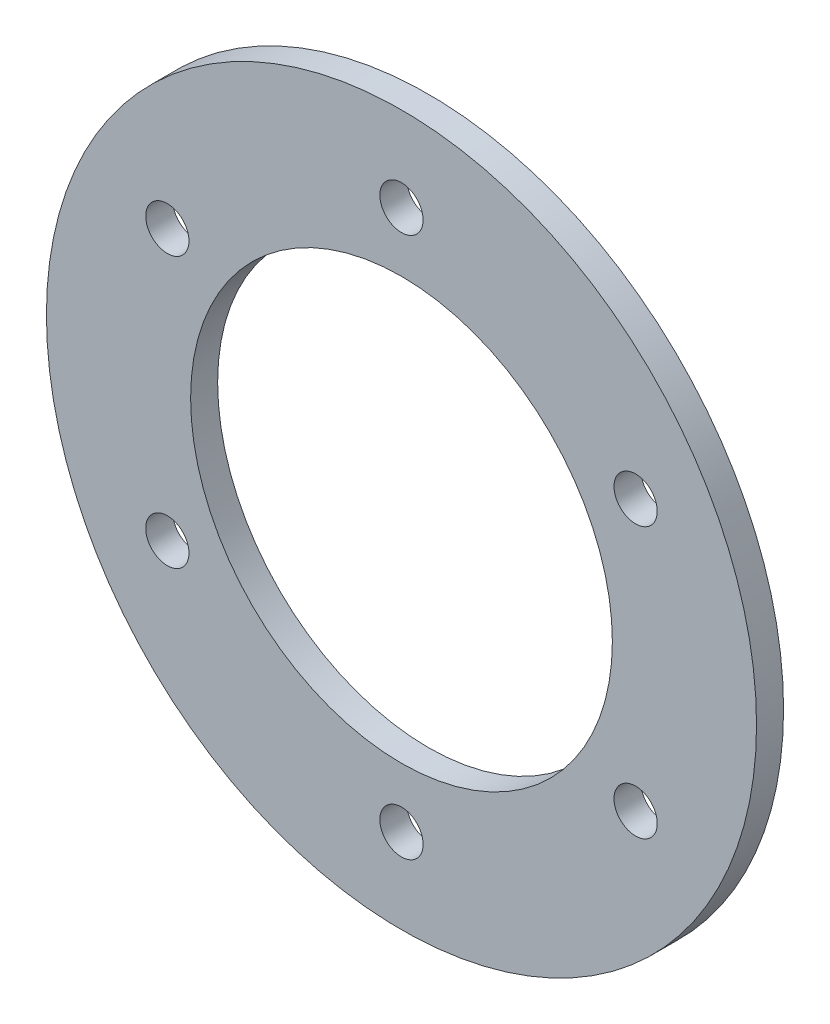
ISO-10303-21;
HEADER;
FILE_DESCRIPTION(('STEP AP214'),'2;1');
FILE_NAME('part.step','',(''),(''),'','','');
FILE_SCHEMA(('AUTOMOTIVE_DESIGN { 1 0 10303 214 1 1 1 1 }'));
ENDSEC;
DATA;
#1=APPLICATION_CONTEXT('core data for automotive mechanical design processes');
#2=APPLICATION_PROTOCOL_DEFINITION('international standard','automotive_design',2000,#1);
#3=PRODUCT_CONTEXT('',#1,'mechanical');
#4=PRODUCT('Part','Part','',(#3));
#5=PRODUCT_RELATED_PRODUCT_CATEGORY('part','',(#4));
#6=PRODUCT_DEFINITION_FORMATION('','',#4);
#7=PRODUCT_DEFINITION_CONTEXT('part definition',#1,'design');
#8=PRODUCT_DEFINITION('design','',#6,#7);
#9=PRODUCT_DEFINITION_SHAPE('','',#8);
#10=(LENGTH_UNIT() NAMED_UNIT(*) SI_UNIT(.MILLI.,.METRE.));
#11=(NAMED_UNIT(*) PLANE_ANGLE_UNIT() SI_UNIT($,.RADIAN.));
#12=(NAMED_UNIT(*) SI_UNIT($,.STERADIAN.) SOLID_ANGLE_UNIT());
#13=UNCERTAINTY_MEASURE_WITH_UNIT(LENGTH_MEASURE(1.E-05),#10,'distance_accuracy_value','');
#14=(GEOMETRIC_REPRESENTATION_CONTEXT(3) GLOBAL_UNCERTAINTY_ASSIGNED_CONTEXT((#13)) GLOBAL_UNIT_ASSIGNED_CONTEXT((#10,
#11,#12)) REPRESENTATION_CONTEXT('',''));
#15=CARTESIAN_POINT('',(0.,0.,0.));
#16=DIRECTION('',(0.,0.,1.));
#17=DIRECTION('',(1.,0.,0.));
#18=AXIS2_PLACEMENT_3D('',#15,#16,#17);
#19=CARTESIAN_POINT('',(0.,0.,0.75));
#20=DIRECTION('',(0.,0.,1.));
#21=DIRECTION('',(1.,0.,0.));
#22=AXIS2_PLACEMENT_3D('',#19,#20,#21);
#23=PLANE('',#22);
#24=CARTESIAN_POINT('',(0.,15.,0.750000000000001));
#25=DIRECTION('',(0.,0.,1.));
#26=DIRECTION('',(1.,0.,0.));
#27=AXIS2_PLACEMENT_3D('',#24,#25,#26);
#28=CIRCLE('',#27,1.19999999999999);
#29=CARTESIAN_POINT('',(1.19999999999999,15.,0.750000000000001));
#30=VERTEX_POINT('',#29);
#31=EDGE_CURVE('E83',#30,#30,#28,.T.);
#32=ORIENTED_EDGE('',*,*,#31,.F.);
#33=EDGE_LOOP('',(#32));
#34=FACE_BOUND('',#33,.T.);
#35=CARTESIAN_POINT('',(12.9903810567669,7.50000000000055,0.750000000000001));
#36=DIRECTION('',(0.,0.,1.));
#37=DIRECTION('',(1.,0.,0.));
#38=AXIS2_PLACEMENT_3D('',#35,#36,#37);
#39=CIRCLE('',#38,1.19999999999999);
#40=CARTESIAN_POINT('',(14.1903810567669,7.50000000000055,0.750000000000001));
#41=VERTEX_POINT('',#40);
#42=EDGE_CURVE('E77',#41,#41,#39,.T.);
#43=ORIENTED_EDGE('',*,*,#42,.F.);
#44=EDGE_LOOP('',(#43));
#45=FACE_BOUND('',#44,.T.);
#46=CARTESIAN_POINT('',(12.9903810567675,-7.49999999999945,0.750000000000001));
#47=DIRECTION('',(0.,0.,1.));
#48=DIRECTION('',(1.,0.,0.));
#49=AXIS2_PLACEMENT_3D('',#46,#47,#48);
#50=CIRCLE('',#49,1.19999999999999);
#51=CARTESIAN_POINT('',(14.1903810567675,-7.49999999999945,0.750000000000001));
#52=VERTEX_POINT('',#51);
#53=EDGE_CURVE('E71',#52,#52,#50,.T.);
#54=ORIENTED_EDGE('',*,*,#53,.F.);
#55=EDGE_LOOP('',(#54));
#56=FACE_BOUND('',#55,.T.);
#57=CARTESIAN_POINT('',(1.27346601377202E-12,-15.,0.750000000000001));
#58=DIRECTION('',(0.,0.,1.));
#59=DIRECTION('',(1.,0.,0.));
#60=AXIS2_PLACEMENT_3D('',#57,#58,#59);
#61=CIRCLE('',#60,1.19999999999999);
#62=CARTESIAN_POINT('',(1.20000000000126,-15.,0.750000000000001));
#63=VERTEX_POINT('',#62);
#64=EDGE_CURVE('E65',#63,#63,#61,.T.);
#65=ORIENTED_EDGE('',*,*,#64,.F.);
#66=EDGE_LOOP('',(#65));
#67=FACE_BOUND('',#66,.T.);
#68=CARTESIAN_POINT('',(-12.9903810567656,-7.50000000000056,0.750000000000001));
#69=DIRECTION('',(0.,0.,1.));
#70=DIRECTION('',(1.,0.,0.));
#71=AXIS2_PLACEMENT_3D('',#68,#69,#70);
#72=CIRCLE('',#71,1.19999999999999);
#73=CARTESIAN_POINT('',(-11.7903810567656,-7.50000000000056,0.750000000000001));
#74=VERTEX_POINT('',#73);
#75=EDGE_CURVE('E59',#74,#74,#72,.T.);
#76=ORIENTED_EDGE('',*,*,#75,.F.);
#77=EDGE_LOOP('',(#76));
#78=FACE_BOUND('',#77,.T.);
#79=CARTESIAN_POINT('',(-12.9903810567663,7.49999999999945,0.750000000000001));
#80=DIRECTION('',(0.,0.,1.));
#81=DIRECTION('',(1.,0.,0.));
#82=AXIS2_PLACEMENT_3D('',#79,#80,#81);
#83=CIRCLE('',#82,1.19999999999999);
#84=CARTESIAN_POINT('',(-11.7903810567663,7.49999999999945,0.750000000000001));
#85=VERTEX_POINT('',#84);
#86=EDGE_CURVE('E53',#85,#85,#83,.T.);
#87=ORIENTED_EDGE('',*,*,#86,.F.);
#88=EDGE_LOOP('',(#87));
#89=FACE_BOUND('',#88,.T.);
#90=CARTESIAN_POINT('',(0.,0.,0.75));
#91=DIRECTION('',(0.,0.,1.));
#92=DIRECTION('',(1.,0.,0.));
#93=AXIS2_PLACEMENT_3D('',#90,#91,#92);
#94=CIRCLE('',#93,19.7);
#95=CARTESIAN_POINT('',(19.7,0.,0.75));
#96=VERTEX_POINT('',#95);
#97=EDGE_CURVE('E10',#96,#96,#94,.T.);
#98=ORIENTED_EDGE('',*,*,#97,.T.);
#99=EDGE_LOOP('',(#98));
#100=FACE_BOUND('',#99,.T.);
#101=CARTESIAN_POINT('',(0.,0.,0.75));
#102=DIRECTION('',(0.,0.,1.));
#103=DIRECTION('',(1.,0.,0.));
#104=AXIS2_PLACEMENT_3D('',#101,#102,#103);
#105=CIRCLE('',#104,11.7);
#106=CARTESIAN_POINT('',(11.7,0.,0.75));
#107=VERTEX_POINT('',#106);
#108=EDGE_CURVE('E43',#107,#107,#105,.T.);
#109=ORIENTED_EDGE('',*,*,#108,.F.);
#110=EDGE_LOOP('',(#109));
#111=FACE_BOUND('',#110,.T.);
#112=ADVANCED_FACE('F32',(#34,#45,#56,#67,#78,#89,#100,#111),#23,.T.);
#113=CARTESIAN_POINT('',(0.,0.,-0.75));
#114=DIRECTION('',(0.,0.,1.));
#115=DIRECTION('',(1.,0.,0.));
#116=AXIS2_PLACEMENT_3D('',#113,#114,#115);
#117=PLANE('',#116);
#118=CARTESIAN_POINT('',(0.,15.,-0.75));
#119=DIRECTION('',(0.,0.,1.));
#120=DIRECTION('',(1.,0.,0.));
#121=AXIS2_PLACEMENT_3D('',#118,#119,#120);
#122=CIRCLE('',#121,1.19999999999999);
#123=CARTESIAN_POINT('',(1.19999999999999,15.,-0.75));
#124=VERTEX_POINT('',#123);
#125=EDGE_CURVE('E80',#124,#124,#122,.T.);
#126=ORIENTED_EDGE('',*,*,#125,.T.);
#127=EDGE_LOOP('',(#126));
#128=FACE_BOUND('',#127,.T.);
#129=CARTESIAN_POINT('',(12.9903810567669,7.50000000000055,-0.75));
#130=DIRECTION('',(0.,0.,1.));
#131=DIRECTION('',(1.,0.,0.));
#132=AXIS2_PLACEMENT_3D('',#129,#130,#131);
#133=CIRCLE('',#132,1.19999999999999);
#134=CARTESIAN_POINT('',(14.1903810567669,7.50000000000055,-0.75));
#135=VERTEX_POINT('',#134);
#136=EDGE_CURVE('E74',#135,#135,#133,.T.);
#137=ORIENTED_EDGE('',*,*,#136,.T.);
#138=EDGE_LOOP('',(#137));
#139=FACE_BOUND('',#138,.T.);
#140=CARTESIAN_POINT('',(12.9903810567675,-7.49999999999945,-0.75));
#141=DIRECTION('',(0.,0.,1.));
#142=DIRECTION('',(1.,0.,0.));
#143=AXIS2_PLACEMENT_3D('',#140,#141,#142);
#144=CIRCLE('',#143,1.19999999999999);
#145=CARTESIAN_POINT('',(14.1903810567675,-7.49999999999945,-0.75));
#146=VERTEX_POINT('',#145);
#147=EDGE_CURVE('E68',#146,#146,#144,.T.);
#148=ORIENTED_EDGE('',*,*,#147,.T.);
#149=EDGE_LOOP('',(#148));
#150=FACE_BOUND('',#149,.T.);
#151=CARTESIAN_POINT('',(1.27346601377202E-12,-15.,-0.75));
#152=DIRECTION('',(0.,0.,1.));
#153=DIRECTION('',(1.,0.,0.));
#154=AXIS2_PLACEMENT_3D('',#151,#152,#153);
#155=CIRCLE('',#154,1.19999999999999);
#156=CARTESIAN_POINT('',(1.20000000000127,-15.,-0.75));
#157=VERTEX_POINT('',#156);
#158=EDGE_CURVE('E62',#157,#157,#155,.T.);
#159=ORIENTED_EDGE('',*,*,#158,.T.);
#160=EDGE_LOOP('',(#159));
#161=FACE_BOUND('',#160,.T.);
#162=CARTESIAN_POINT('',(-12.9903810567656,-7.50000000000056,-0.75));
#163=DIRECTION('',(0.,0.,1.));
#164=DIRECTION('',(1.,0.,0.));
#165=AXIS2_PLACEMENT_3D('',#162,#163,#164);
#166=CIRCLE('',#165,1.19999999999999);
#167=CARTESIAN_POINT('',(-11.7903810567656,-7.50000000000056,-0.75));
#168=VERTEX_POINT('',#167);
#169=EDGE_CURVE('E56',#168,#168,#166,.T.);
#170=ORIENTED_EDGE('',*,*,#169,.T.);
#171=EDGE_LOOP('',(#170));
#172=FACE_BOUND('',#171,.T.);
#173=CARTESIAN_POINT('',(-12.9903810567663,7.49999999999945,-0.75));
#174=DIRECTION('',(0.,0.,1.));
#175=DIRECTION('',(1.,0.,0.));
#176=AXIS2_PLACEMENT_3D('',#173,#174,#175);
#177=CIRCLE('',#176,1.19999999999999);
#178=CARTESIAN_POINT('',(-11.7903810567663,7.49999999999945,-0.75));
#179=VERTEX_POINT('',#178);
#180=EDGE_CURVE('E48',#179,#179,#177,.T.);
#181=ORIENTED_EDGE('',*,*,#180,.T.);
#182=EDGE_LOOP('',(#181));
#183=FACE_BOUND('',#182,.T.);
#184=CARTESIAN_POINT('',(0.,0.,-0.75));
#185=DIRECTION('',(0.,0.,1.));
#186=DIRECTION('',(1.,0.,0.));
#187=AXIS2_PLACEMENT_3D('',#184,#185,#186);
#188=CIRCLE('',#187,19.7);
#189=CARTESIAN_POINT('',(19.7,0.,-0.75));
#190=VERTEX_POINT('',#189);
#191=EDGE_CURVE('E36',#190,#190,#188,.T.);
#192=ORIENTED_EDGE('',*,*,#191,.F.);
#193=EDGE_LOOP('',(#192));
#194=FACE_BOUND('',#193,.T.);
#195=CARTESIAN_POINT('',(0.,0.,-0.75));
#196=DIRECTION('',(0.,0.,1.));
#197=DIRECTION('',(1.,0.,0.));
#198=AXIS2_PLACEMENT_3D('',#195,#196,#197);
#199=CIRCLE('',#198,11.7);
#200=CARTESIAN_POINT('',(11.7,0.,-0.75));
#201=VERTEX_POINT('',#200);
#202=EDGE_CURVE('E45',#201,#201,#199,.T.);
#203=ORIENTED_EDGE('',*,*,#202,.T.);
#204=EDGE_LOOP('',(#203));
#205=FACE_BOUND('',#204,.T.);
#206=ADVANCED_FACE('F91',(#128,#139,#150,#161,#172,#183,#194,#205),#117,.F.);
#207=CARTESIAN_POINT('',(0.,0.,0.75));
#208=DIRECTION('',(0.,0.,-1.));
#209=DIRECTION('',(-1.,0.,0.));
#210=AXIS2_PLACEMENT_3D('',#207,#208,#209);
#211=CYLINDRICAL_SURFACE('',#210,19.7);
#212=ORIENTED_EDGE('',*,*,#97,.F.);
#213=EDGE_LOOP('',(#212));
#214=FACE_BOUND('',#213,.T.);
#215=ORIENTED_EDGE('',*,*,#191,.T.);
#216=EDGE_LOOP('',(#215));
#217=FACE_BOUND('',#216,.T.);
#218=ADVANCED_FACE('F34',(#214,#217),#211,.T.);
#219=CARTESIAN_POINT('',(0.,0.,0.75));
#220=DIRECTION('',(0.,0.,-1.));
#221=DIRECTION('',(-1.,0.,0.));
#222=AXIS2_PLACEMENT_3D('',#219,#220,#221);
#223=CYLINDRICAL_SURFACE('',#222,11.7);
#224=ORIENTED_EDGE('',*,*,#108,.T.);
#225=EDGE_LOOP('',(#224));
#226=FACE_BOUND('',#225,.T.);
#227=ORIENTED_EDGE('',*,*,#202,.F.);
#228=EDGE_LOOP('',(#227));
#229=FACE_BOUND('',#228,.T.);
#230=ADVANCED_FACE('F105',(#226,#229),#223,.F.);
#231=CARTESIAN_POINT('',(-12.9903810567663,7.49999999999945,0.75));
#232=DIRECTION('',(0.,0.,1.));
#233=DIRECTION('',(1.,0.,0.));
#234=AXIS2_PLACEMENT_3D('',#231,#232,#233);
#235=CYLINDRICAL_SURFACE('',#234,1.19999999999999);
#236=ORIENTED_EDGE('',*,*,#180,.F.);
#237=EDGE_LOOP('',(#236));
#238=FACE_BOUND('',#237,.T.);
#239=ORIENTED_EDGE('',*,*,#86,.T.);
#240=EDGE_LOOP('',(#239));
#241=FACE_BOUND('',#240,.T.);
#242=ADVANCED_FACE('F108',(#238,#241),#235,.F.);
#243=CARTESIAN_POINT('',(-12.9903810567656,-7.50000000000056,0.75));
#244=DIRECTION('',(0.,0.,1.));
#245=DIRECTION('',(1.,0.,0.));
#246=AXIS2_PLACEMENT_3D('',#243,#244,#245);
#247=CYLINDRICAL_SURFACE('',#246,1.19999999999999);
#248=ORIENTED_EDGE('',*,*,#169,.F.);
#249=EDGE_LOOP('',(#248));
#250=FACE_BOUND('',#249,.T.);
#251=ORIENTED_EDGE('',*,*,#75,.T.);
#252=EDGE_LOOP('',(#251));
#253=FACE_BOUND('',#252,.T.);
#254=ADVANCED_FACE('F122',(#250,#253),#247,.F.);
#255=CARTESIAN_POINT('',(1.27346601377202E-12,-15.,0.75));
#256=DIRECTION('',(0.,0.,1.));
#257=DIRECTION('',(1.,0.,0.));
#258=AXIS2_PLACEMENT_3D('',#255,#256,#257);
#259=CYLINDRICAL_SURFACE('',#258,1.19999999999999);
#260=ORIENTED_EDGE('',*,*,#158,.F.);
#261=EDGE_LOOP('',(#260));
#262=FACE_BOUND('',#261,.T.);
#263=ORIENTED_EDGE('',*,*,#64,.T.);
#264=EDGE_LOOP('',(#263));
#265=FACE_BOUND('',#264,.T.);
#266=ADVANCED_FACE('F126',(#262,#265),#259,.F.);
#267=CARTESIAN_POINT('',(12.9903810567675,-7.49999999999945,0.75));
#268=DIRECTION('',(0.,0.,1.));
#269=DIRECTION('',(1.,0.,0.));
#270=AXIS2_PLACEMENT_3D('',#267,#268,#269);
#271=CYLINDRICAL_SURFACE('',#270,1.19999999999999);
#272=ORIENTED_EDGE('',*,*,#147,.F.);
#273=EDGE_LOOP('',(#272));
#274=FACE_BOUND('',#273,.T.);
#275=ORIENTED_EDGE('',*,*,#53,.T.);
#276=EDGE_LOOP('',(#275));
#277=FACE_BOUND('',#276,.T.);
#278=ADVANCED_FACE('F130',(#274,#277),#271,.F.);
#279=CARTESIAN_POINT('',(12.9903810567669,7.50000000000055,0.75));
#280=DIRECTION('',(0.,0.,1.));
#281=DIRECTION('',(1.,0.,0.));
#282=AXIS2_PLACEMENT_3D('',#279,#280,#281);
#283=CYLINDRICAL_SURFACE('',#282,1.19999999999999);
#284=ORIENTED_EDGE('',*,*,#136,.F.);
#285=EDGE_LOOP('',(#284));
#286=FACE_BOUND('',#285,.T.);
#287=ORIENTED_EDGE('',*,*,#42,.T.);
#288=EDGE_LOOP('',(#287));
#289=FACE_BOUND('',#288,.T.);
#290=ADVANCED_FACE('F134',(#286,#289),#283,.F.);
#291=CARTESIAN_POINT('',(0.,15.,0.75));
#292=DIRECTION('',(0.,0.,1.));
#293=DIRECTION('',(1.,0.,0.));
#294=AXIS2_PLACEMENT_3D('',#291,#292,#293);
#295=CYLINDRICAL_SURFACE('',#294,1.19999999999999);
#296=ORIENTED_EDGE('',*,*,#125,.F.);
#297=EDGE_LOOP('',(#296));
#298=FACE_BOUND('',#297,.T.);
#299=ORIENTED_EDGE('',*,*,#31,.T.);
#300=EDGE_LOOP('',(#299));
#301=FACE_BOUND('',#300,.T.);
#302=ADVANCED_FACE('F87',(#298,#301),#295,.F.);
#303=CLOSED_SHELL('',(#112,#206,#218,#230,#242,#254,#266,#278,#290,#302));
#304=MANIFOLD_SOLID_BREP('B2',#303);
#305=ADVANCED_BREP_SHAPE_REPRESENTATION('',(#18,#304),#14);
#306=SHAPE_DEFINITION_REPRESENTATION(#9,#305);
ENDSEC;
END-ISO-10303-21;
